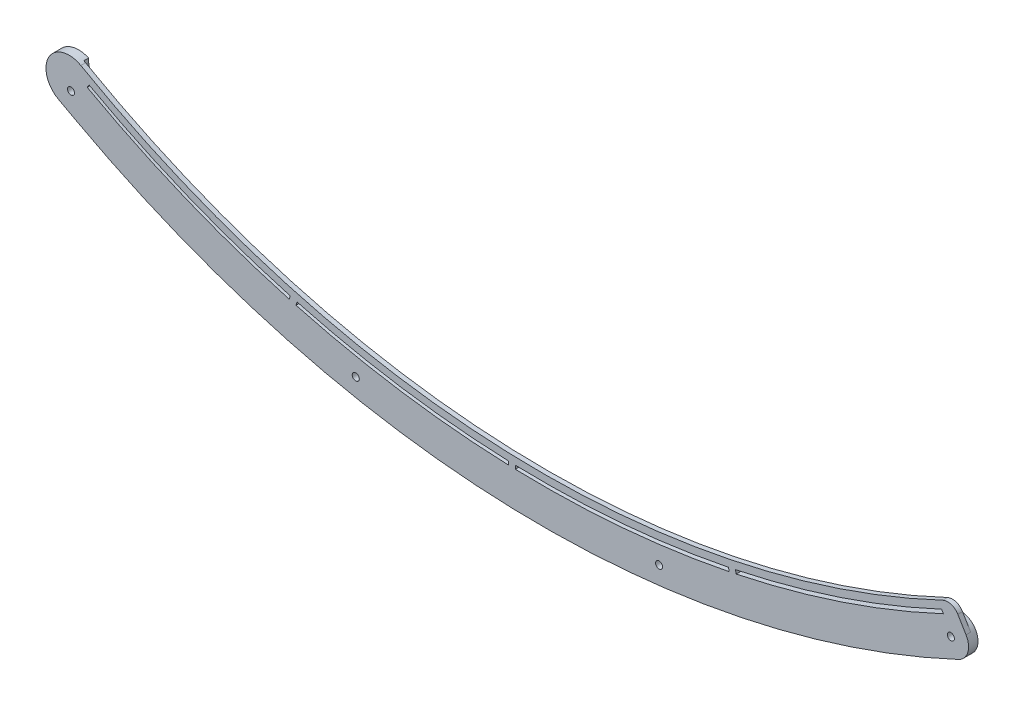
ISO-10303-21;
HEADER;
FILE_DESCRIPTION(('STEP AP214'),'2;1');
FILE_NAME('part.step','',(''),(''),'','','');
FILE_SCHEMA(('AUTOMOTIVE_DESIGN { 1 0 10303 214 1 1 1 1 }'));
ENDSEC;
DATA;
#1=APPLICATION_CONTEXT('core data for automotive mechanical design processes');
#2=APPLICATION_PROTOCOL_DEFINITION('international standard','automotive_design',2000,#1);
#3=PRODUCT_CONTEXT('',#1,'mechanical');
#4=PRODUCT('Part','Part','',(#3));
#5=PRODUCT_RELATED_PRODUCT_CATEGORY('part','',(#4));
#6=PRODUCT_DEFINITION_FORMATION('','',#4);
#7=PRODUCT_DEFINITION_CONTEXT('part definition',#1,'design');
#8=PRODUCT_DEFINITION('design','',#6,#7);
#9=PRODUCT_DEFINITION_SHAPE('','',#8);
#10=(LENGTH_UNIT() NAMED_UNIT(*) SI_UNIT(.MILLI.,.METRE.));
#11=(NAMED_UNIT(*) PLANE_ANGLE_UNIT() SI_UNIT($,.RADIAN.));
#12=(NAMED_UNIT(*) SI_UNIT($,.STERADIAN.) SOLID_ANGLE_UNIT());
#13=UNCERTAINTY_MEASURE_WITH_UNIT(LENGTH_MEASURE(1.E-05),#10,'distance_accuracy_value','');
#14=(GEOMETRIC_REPRESENTATION_CONTEXT(3) GLOBAL_UNCERTAINTY_ASSIGNED_CONTEXT((#13)) GLOBAL_UNIT_ASSIGNED_CONTEXT((#10,
#11,#12)) REPRESENTATION_CONTEXT('',''));
#15=CARTESIAN_POINT('',(0.,0.,0.));
#16=DIRECTION('',(0.,0.,1.));
#17=DIRECTION('',(1.,0.,0.));
#18=AXIS2_PLACEMENT_3D('',#15,#16,#17);
#19=CARTESIAN_POINT('',(0.,0.,2.));
#20=DIRECTION('',(0.,0.,1.));
#21=DIRECTION('',(1.,0.,0.));
#22=AXIS2_PLACEMENT_3D('',#19,#20,#21);
#23=CYLINDRICAL_SURFACE('',#22,398.5);
#24=DIRECTION('',(0.,0.,1.));
#25=VECTOR('',#24,1.);
#26=CARTESIAN_POINT('',(81.6819939898594,-390.038846601003,2.));
#27=LINE('',#26,#25);
#28=CARTESIAN_POINT('',(81.6819939898595,-390.038846601003,2.));
#29=VERTEX_POINT('',#28);
#30=CARTESIAN_POINT('',(81.6819939898595,-390.038846601003,4.));
#31=VERTEX_POINT('',#30);
#32=EDGE_CURVE('E236',#29,#31,#27,.T.);
#33=ORIENTED_EDGE('',*,*,#32,.F.);
#34=CARTESIAN_POINT('',(0.,0.,2.));
#35=DIRECTION('',(0.,0.,1.));
#36=DIRECTION('',(-1.,0.,0.));
#37=AXIS2_PLACEMENT_3D('',#34,#35,#36);
#38=CIRCLE('',#37,398.5);
#39=CARTESIAN_POINT('',(169.003770429104,-360.887760364281,2.));
#40=VERTEX_POINT('',#39);
#41=EDGE_CURVE('E336',#29,#40,#38,.T.);
#42=ORIENTED_EDGE('',*,*,#41,.T.);
#43=DIRECTION('',(0.,0.,1.));
#44=VECTOR('',#43,1.);
#45=CARTESIAN_POINT('',(169.003770429104,-360.887760364281,2.));
#46=LINE('',#45,#44);
#47=CARTESIAN_POINT('',(169.003770429104,-360.887760364281,4.));
#48=VERTEX_POINT('',#47);
#49=EDGE_CURVE('E324',#40,#48,#46,.T.);
#50=ORIENTED_EDGE('',*,*,#49,.T.);
#51=CARTESIAN_POINT('',(0.,0.,4.));
#52=DIRECTION('',(0.,0.,1.));
#53=DIRECTION('',(-1.,0.,0.));
#54=AXIS2_PLACEMENT_3D('',#51,#52,#53);
#55=CIRCLE('',#54,398.5);
#56=EDGE_CURVE('E71',#31,#48,#55,.T.);
#57=ORIENTED_EDGE('',*,*,#56,.F.);
#58=EDGE_LOOP('',(#33,#42,#50,#57));
#59=FACE_BOUND('',#58,.T.);
#60=ADVANCED_FACE('F48',(#59),#23,.T.);
#61=DIRECTION('',(0.,0.,1.));
#62=VECTOR('',#61,1.);
#63=CARTESIAN_POINT('',(78.7433976744266,-390.642710571549,2.));
#64=LINE('',#63,#62);
#65=CARTESIAN_POINT('',(78.7433976744266,-390.642710571549,4.));
#66=VERTEX_POINT('',#65);
#67=CARTESIAN_POINT('',(78.7433976744266,-390.642710571549,2.));
#68=VERTEX_POINT('',#67);
#69=EDGE_CURVE('E248',#66,#68,#64,.F.);
#70=ORIENTED_EDGE('',*,*,#69,.F.);
#71=CARTESIAN_POINT('',(-11.4984028552228,-398.334076789545,4.));
#72=VERTEX_POINT('',#71);
#73=EDGE_CURVE('E425',#72,#66,#55,.T.);
#74=ORIENTED_EDGE('',*,*,#73,.F.);
#75=DIRECTION('',(0.,0.,1.));
#76=VECTOR('',#75,1.);
#77=CARTESIAN_POINT('',(-11.4984028552228,-398.334076789545,2.));
#78=LINE('',#77,#76);
#79=CARTESIAN_POINT('',(-11.4984028552228,-398.334076789545,2.));
#80=VERTEX_POINT('',#79);
#81=EDGE_CURVE('E384',#80,#72,#78,.T.);
#82=ORIENTED_EDGE('',*,*,#81,.F.);
#83=EDGE_CURVE('E435',#80,#68,#38,.T.);
#84=ORIENTED_EDGE('',*,*,#83,.T.);
#85=EDGE_LOOP('',(#70,#74,#82,#84));
#86=FACE_BOUND('',#85,.T.);
#87=ADVANCED_FACE('F553',(#86),#23,.T.);
#88=DIRECTION('',(0.,0.,1.));
#89=VECTOR('',#88,1.);
#90=CARTESIAN_POINT('',(-14.4968066711785,-398.236227126989,2.));
#91=LINE('',#90,#89);
#92=CARTESIAN_POINT('',(-14.4968066711785,-398.236227126989,4.));
#93=VERTEX_POINT('',#92);
#94=CARTESIAN_POINT('',(-14.4968066711785,-398.236227126989,2.));
#95=VERTEX_POINT('',#94);
#96=EDGE_CURVE('E391',#93,#95,#91,.F.);
#97=ORIENTED_EDGE('',*,*,#96,.F.);
#98=CARTESIAN_POINT('',(-104.04513682366,-384.677604629313,4.));
#99=VERTEX_POINT('',#98);
#100=EDGE_CURVE('E346',#99,#93,#55,.T.);
#101=ORIENTED_EDGE('',*,*,#100,.F.);
#102=DIRECTION('',(0.,0.,1.));
#103=VECTOR('',#102,1.);
#104=CARTESIAN_POINT('',(-104.04513682366,-384.677604629313,2.));
#105=LINE('',#104,#103);
#106=CARTESIAN_POINT('',(-104.04513682366,-384.677604629313,2.));
#107=VERTEX_POINT('',#106);
#108=EDGE_CURVE('E12',#107,#99,#105,.T.);
#109=ORIENTED_EDGE('',*,*,#108,.F.);
#110=EDGE_CURVE('E358',#107,#95,#38,.T.);
#111=ORIENTED_EDGE('',*,*,#110,.T.);
#112=EDGE_LOOP('',(#97,#101,#109,#111));
#113=FACE_BOUND('',#112,.T.);
#114=ADVANCED_FACE('F558',(#113),#23,.T.);
#115=CARTESIAN_POINT('',(0.,0.,4.));
#116=DIRECTION('',(0.,0.,-1.));
#117=DIRECTION('',(-1.,0.,0.));
#118=AXIS2_PLACEMENT_3D('',#115,#116,#117);
#119=CYLINDRICAL_SURFACE('',#118,400.);
#120=CARTESIAN_POINT('',(0.,0.,2.));
#121=DIRECTION('',(0.,0.,-1.));
#122=DIRECTION('',(-1.,0.,0.));
#123=AXIS2_PLACEMENT_3D('',#120,#121,#122);
#124=CIRCLE('',#123,400.);
#125=CARTESIAN_POINT('',(79.0453317906727,-392.112019099265,2.));
#126=VERTEX_POINT('',#125);
#127=CARTESIAN_POINT('',(81.9839281061056,-391.508155128719,2.));
#128=VERTEX_POINT('',#127);
#129=EDGE_CURVE('E247',#126,#128,#124,.F.);
#130=ORIENTED_EDGE('',*,*,#129,.T.);
#131=DIRECTION('',(0.,0.,-1.));
#132=VECTOR('',#131,1.);
#133=CARTESIAN_POINT('',(81.9839281061056,-391.508155128719,4.));
#134=LINE('',#133,#132);
#135=CARTESIAN_POINT('',(81.9839281061056,-391.508155128719,4.));
#136=VERTEX_POINT('',#135);
#137=EDGE_CURVE('E234',#128,#136,#134,.F.);
#138=ORIENTED_EDGE('',*,*,#137,.T.);
#139=CARTESIAN_POINT('',(0.,0.,4.));
#140=DIRECTION('',(0.,0.,-1.));
#141=DIRECTION('',(-1.,0.,0.));
#142=AXIS2_PLACEMENT_3D('',#139,#140,#141);
#143=CIRCLE('',#142,400.);
#144=CARTESIAN_POINT('',(169.760416098082,-362.189730840351,4.));
#145=VERTEX_POINT('',#144);
#146=EDGE_CURVE('E244',#145,#136,#143,.T.);
#147=ORIENTED_EDGE('',*,*,#146,.F.);
#148=DIRECTION('',(0.,0.,1.));
#149=VECTOR('',#148,1.);
#150=CARTESIAN_POINT('',(169.760416098082,-362.189730840351,2.));
#151=LINE('',#150,#149);
#152=CARTESIAN_POINT('',(169.760416098082,-362.189730840351,2.));
#153=VERTEX_POINT('',#152);
#154=EDGE_CURVE('E326',#153,#145,#151,.T.);
#155=ORIENTED_EDGE('',*,*,#154,.F.);
#156=DIRECTION('',(0.,0.,1.));
#157=VECTOR('',#156,1.);
#158=CARTESIAN_POINT('',(169.760416098082,-362.189730840351,0.));
#159=LINE('',#158,#157);
#160=CARTESIAN_POINT('',(169.760416098082,-362.189730840351,0.));
#161=VERTEX_POINT('',#160);
#162=EDGE_CURVE('E286',#161,#153,#159,.T.);
#163=ORIENTED_EDGE('',*,*,#162,.F.);
#164=CARTESIAN_POINT('',(0.,0.,0.));
#165=DIRECTION('',(0.,0.,-1.));
#166=DIRECTION('',(-1.,0.,0.));
#167=AXIS2_PLACEMENT_3D('',#164,#165,#166);
#168=CIRCLE('',#167,400.);
#169=CARTESIAN_POINT('',(-192.90268679393,-350.411976718381,0.));
#170=VERTEX_POINT('',#169);
#171=EDGE_CURVE('E275',#161,#170,#168,.T.);
#172=ORIENTED_EDGE('',*,*,#171,.T.);
#173=DIRECTION('',(0.,0.,-1.));
#174=VECTOR('',#173,1.);
#175=CARTESIAN_POINT('',(-192.90268679393,-350.411976718381,4.));
#176=LINE('',#175,#174);
#177=CARTESIAN_POINT('',(-192.90268679393,-350.411976718381,2.));
#178=VERTEX_POINT('',#177);
#179=EDGE_CURVE('E259',#170,#178,#176,.F.);
#180=ORIENTED_EDGE('',*,*,#179,.T.);
#181=CARTESIAN_POINT('',(0.,0.,2.));
#182=DIRECTION('',(0.,0.,-1.));
#183=DIRECTION('',(-1.,0.,0.));
#184=AXIS2_PLACEMENT_3D('',#181,#182,#183);
#185=CIRCLE('',#184,400.);
#186=CARTESIAN_POINT('',(-192.896852500104,-350.415188448722,2.));
#187=VERTEX_POINT('',#186);
#188=EDGE_CURVE('E318',#178,#187,#185,.F.);
#189=ORIENTED_EDGE('',*,*,#188,.T.);
#190=DIRECTION('',(0.,0.,-1.));
#191=VECTOR('',#190,1.);
#192=CARTESIAN_POINT('',(-192.896852500104,-350.415188448722,4.));
#193=LINE('',#192,#191);
#194=CARTESIAN_POINT('',(-192.896852500104,-350.415188448722,4.));
#195=VERTEX_POINT('',#194);
#196=EDGE_CURVE('E311',#187,#195,#193,.F.);
#197=ORIENTED_EDGE('',*,*,#196,.T.);
#198=CARTESIAN_POINT('',(-107.335198046821,-385.329930397639,4.));
#199=VERTEX_POINT('',#198);
#200=EDGE_CURVE('E258',#199,#195,#143,.T.);
#201=ORIENTED_EDGE('',*,*,#200,.F.);
#202=DIRECTION('',(0.,0.,-1.));
#203=VECTOR('',#202,1.);
#204=CARTESIAN_POINT('',(-107.335198046821,-385.329930397639,4.));
#205=LINE('',#204,#203);
#206=CARTESIAN_POINT('',(-107.335198046821,-385.329930397639,2.));
#207=VERTEX_POINT('',#206);
#208=EDGE_CURVE('E369',#199,#207,#205,.T.);
#209=ORIENTED_EDGE('',*,*,#208,.T.);
#210=CARTESIAN_POINT('',(0.,0.,2.));
#211=DIRECTION('',(0.,0.,-1.));
#212=DIRECTION('',(-1.,0.,0.));
#213=AXIS2_PLACEMENT_3D('',#210,#211,#212);
#214=CIRCLE('',#213,400.);
#215=CARTESIAN_POINT('',(-104.442225086599,-386.124101318424,2.));
#216=VERTEX_POINT('',#215);
#217=EDGE_CURVE('E372',#207,#216,#214,.F.);
#218=ORIENTED_EDGE('',*,*,#217,.T.);
#219=DIRECTION('',(0.,0.,-1.));
#220=VECTOR('',#219,1.);
#221=CARTESIAN_POINT('',(-104.442225086599,-386.124101318424,4.));
#222=LINE('',#221,#220);
#223=CARTESIAN_POINT('',(-104.442225086599,-386.124101318424,4.));
#224=VERTEX_POINT('',#223);
#225=EDGE_CURVE('E366',#216,#224,#222,.F.);
#226=ORIENTED_EDGE('',*,*,#225,.T.);
#227=CARTESIAN_POINT('',(-14.5457318477578,-399.73543961602,4.));
#228=VERTEX_POINT('',#227);
#229=EDGE_CURVE('E261',#228,#224,#143,.T.);
#230=ORIENTED_EDGE('',*,*,#229,.F.);
#231=DIRECTION('',(0.,0.,-1.));
#232=VECTOR('',#231,1.);
#233=CARTESIAN_POINT('',(-14.5457318477578,-399.73543961602,4.));
#234=LINE('',#233,#232);
#235=CARTESIAN_POINT('',(-14.5457318477578,-399.73543961602,2.));
#236=VERTEX_POINT('',#235);
#237=EDGE_CURVE('E394',#228,#236,#234,.T.);
#238=ORIENTED_EDGE('',*,*,#237,.T.);
#239=CARTESIAN_POINT('',(0.,0.,2.));
#240=DIRECTION('',(0.,0.,-1.));
#241=DIRECTION('',(-1.,0.,0.));
#242=AXIS2_PLACEMENT_3D('',#239,#240,#241);
#243=CIRCLE('',#242,400.);
#244=CARTESIAN_POINT('',(-11.5473280318021,-399.833289278577,2.));
#245=VERTEX_POINT('',#244);
#246=EDGE_CURVE('E397',#236,#245,#243,.F.);
#247=ORIENTED_EDGE('',*,*,#246,.T.);
#248=DIRECTION('',(0.,0.,-1.));
#249=VECTOR('',#248,1.);
#250=CARTESIAN_POINT('',(-11.5473280318021,-399.833289278577,4.));
#251=LINE('',#250,#249);
#252=CARTESIAN_POINT('',(-11.5473280318021,-399.833289278577,4.));
#253=VERTEX_POINT('',#252);
#254=EDGE_CURVE('E388',#245,#253,#251,.F.);
#255=ORIENTED_EDGE('',*,*,#254,.T.);
#256=CARTESIAN_POINT('',(79.0453317906727,-392.112019099265,4.));
#257=VERTEX_POINT('',#256);
#258=EDGE_CURVE('E256',#257,#253,#143,.T.);
#259=ORIENTED_EDGE('',*,*,#258,.F.);
#260=DIRECTION('',(0.,0.,-1.));
#261=VECTOR('',#260,1.);
#262=CARTESIAN_POINT('',(79.0453317906727,-392.112019099265,4.));
#263=LINE('',#262,#261);
#264=EDGE_CURVE('E413',#257,#126,#263,.T.);
#265=ORIENTED_EDGE('',*,*,#264,.T.);
#266=EDGE_LOOP('',(#130,#138,#147,#155,#163,#172,#180,#189,#197,#201,#209,#218,#226,#230,#238,
#247,#255,#259,#265));
#267=FACE_BOUND('',#266,.T.);
#268=ADVANCED_FACE('F243',(#267),#119,.F.);
#269=CARTESIAN_POINT('',(0.,0.,4.));
#270=DIRECTION('',(0.,0.,1.));
#271=DIRECTION('',(1.,0.,0.));
#272=AXIS2_PLACEMENT_3D('',#269,#270,#271);
#273=PLANE('',#272);
#274=ORIENTED_EDGE('',*,*,#73,.T.);
#275=DIRECTION('',(0.201287990182129,-0.979532105144308,0.));
#276=VECTOR('',#275,1.);
#277=CARTESIAN_POINT('',(80.152981861137,-397.50220062129,4.));
#278=LINE('',#277,#276);
#279=EDGE_CURVE('E239',#66,#257,#278,.T.);
#280=ORIENTED_EDGE('',*,*,#279,.T.);
#281=ORIENTED_EDGE('',*,*,#258,.T.);
#282=DIRECTION('',(0.0326165541854028,0.999467938651896,0.));
#283=VECTOR('',#282,1.);
#284=CARTESIAN_POINT('',(-11.726810814203,-405.333173954622,4.));
#285=LINE('',#284,#283);
#286=EDGE_CURVE('E406',#253,#72,#285,.T.);
#287=ORIENTED_EDGE('',*,*,#286,.T.);
#288=EDGE_LOOP('',(#274,#280,#281,#287));
#289=FACE_BOUND('',#288,.T.);
#290=ORIENTED_EDGE('',*,*,#146,.T.);
#291=DIRECTION('',(-0.20128799018213,0.979532105144308,0.));
#292=VECTOR('',#291,1.);
#293=CARTESIAN_POINT('',(83.09157817657,-396.898336650744,4.));
#294=LINE('',#293,#292);
#295=EDGE_CURVE('E230',#136,#31,#294,.T.);
#296=ORIENTED_EDGE('',*,*,#295,.T.);
#297=ORIENTED_EDGE('',*,*,#56,.T.);
#298=DIRECTION('',(0.502464653495258,-0.864597751551489,0.));
#299=VECTOR('',#298,1.);
#300=CARTESIAN_POINT('',(169.003770429104,-360.887760364281,4.));
#301=LINE('',#300,#299);
#302=EDGE_CURVE('E254',#48,#145,#301,.T.);
#303=ORIENTED_EDGE('',*,*,#302,.T.);
#304=EDGE_LOOP('',(#290,#296,#297,#303));
#305=FACE_BOUND('',#304,.T.);
#306=CARTESIAN_POINT('',(0.,0.,4.));
#307=DIRECTION('',(0.,0.,-1.));
#308=DIRECTION('',(1.,0.,0.));
#309=AXIS2_PLACEMENT_3D('',#306,#307,#308);
#310=CIRCLE('',#309,395.5);
#311=CARTESIAN_POINT('',(169.454723344945,-357.358848688665,4.));
#312=VERTEX_POINT('',#311);
#313=CARTESIAN_POINT('',(-195.616677725344,-343.735894831627,4.));
#314=VERTEX_POINT('',#313);
#315=EDGE_CURVE('E337',#312,#314,#310,.T.);
#316=ORIENTED_EDGE('',*,*,#315,.T.);
#317=CARTESIAN_POINT('',(-200.562737844821,-352.42706789943,4.));
#318=DIRECTION('',(0.,0.,1.));
#319=DIRECTION('',(1.,0.,0.));
#320=AXIS2_PLACEMENT_3D('',#317,#318,#319);
#321=CIRCLE('',#320,10.);
#322=CARTESIAN_POINT('',(-209.252232214568,-347.478059150383,4.));
#323=VERTEX_POINT('',#322);
#324=EDGE_CURVE('E490',#314,#323,#321,.T.);
#325=ORIENTED_EDGE('',*,*,#324,.T.);
#326=CARTESIAN_POINT('',(-200.364710514774,-352.061939388313,4.));
#327=DIRECTION('',(0.,0.,1.));
#328=DIRECTION('',(1.,0.,0.));
#329=AXIS2_PLACEMENT_3D('',#326,#327,#328);
#330=CIRCLE('',#329,10.);
#331=CARTESIAN_POINT('',(-205.13218330603,-360.85234342821,4.));
#332=VERTEX_POINT('',#331);
#333=EDGE_CURVE('E488',#323,#332,#330,.T.);
#334=ORIENTED_EDGE('',*,*,#333,.T.);
#335=DIRECTION('',(-0.879040403989637,0.476747279125677,0.));
#336=VECTOR('',#335,1.);
#337=CARTESIAN_POINT('',(-213.922587345927,-356.084870636953,4.));
#338=LINE('',#337,#336);
#339=CARTESIAN_POINT('',(-197.850120837155,-364.8017676557,4.));
#340=VERTEX_POINT('',#339);
#341=EDGE_CURVE('E359',#340,#332,#338,.T.);
#342=ORIENTED_EDGE('',*,*,#341,.F.);
#343=CARTESIAN_POINT('',(0.,0.,4.));
#344=DIRECTION('',(0.,0.,1.));
#345=DIRECTION('',(1.,0.,0.));
#346=AXIS2_PLACEMENT_3D('',#343,#344,#345);
#347=CIRCLE('',#346,415.);
#348=CARTESIAN_POINT('',(176.12643170176,-375.771845746865,4.));
#349=VERTEX_POINT('',#348);
#350=EDGE_CURVE('E264',#340,#349,#347,.T.);
#351=ORIENTED_EDGE('',*,*,#350,.T.);
#352=CARTESIAN_POINT('',(172.943423899921,-368.980788293608,4.));
#353=DIRECTION('',(0.,0.,1.));
#354=DIRECTION('',(1.,0.,0.));
#355=AXIS2_PLACEMENT_3D('',#352,#353,#354);
#356=CIRCLE('',#355,7.50000000000006);
#357=CARTESIAN_POINT('',(179.374906332316,-365.122545983722,4.));
#358=VERTEX_POINT('',#357);
#359=EDGE_CURVE('E291',#358,#349,#356,.F.);
#360=ORIENTED_EDGE('',*,*,#359,.F.);
#361=DIRECTION('',(-0.514432307984768,0.85753099098602,0.));
#362=VECTOR('',#361,1.);
#363=CARTESIAN_POINT('',(179.374906332316,-365.122545983722,4.));
#364=LINE('',#363,#362);
#365=CARTESIAN_POINT('',(175.884663045071,-359.304498130899,4.));
#366=VERTEX_POINT('',#365);
#367=EDGE_CURVE('E339',#358,#366,#364,.T.);
#368=ORIENTED_EDGE('',*,*,#367,.T.);
#369=CARTESIAN_POINT('',(171.59700809014,-361.876659670822,4.));
#370=DIRECTION('',(0.,0.,1.));
#371=DIRECTION('',(1.,0.,0.));
#372=AXIS2_PLACEMENT_3D('',#369,#370,#371);
#373=CIRCLE('',#372,5.);
#374=EDGE_CURVE('E454',#366,#312,#373,.T.);
#375=ORIENTED_EDGE('',*,*,#374,.T.);
#376=EDGE_LOOP('',(#316,#325,#334,#342,#351,#360,#368,#375));
#377=FACE_BOUND('',#376,.T.);
#378=ORIENTED_EDGE('',*,*,#100,.T.);
#379=DIRECTION('',(-0.0326165541854028,-0.999467938651896,0.));
#380=VECTOR('',#379,1.);
#381=CARTESIAN_POINT('',(-14.7252146301587,-405.235324292066,4.));
#382=LINE('',#381,#380);
#383=EDGE_CURVE('E405',#93,#228,#382,.T.);
#384=ORIENTED_EDGE('',*,*,#383,.T.);
#385=ORIENTED_EDGE('',*,*,#229,.T.);
#386=DIRECTION('',(0.264723640261418,0.964324320074291,0.));
#387=VECTOR('',#386,1.);
#388=CARTESIAN_POINT('',(-105.898949645892,-391.430597250518,4.));
#389=LINE('',#388,#387);
#390=EDGE_CURVE('E381',#224,#99,#389,.T.);
#391=ORIENTED_EDGE('',*,*,#390,.T.);
#392=EDGE_LOOP('',(#378,#384,#385,#391));
#393=FACE_BOUND('',#392,.T.);
#394=DIRECTION('',(-0.264723640261414,-0.964324320074292,0.));
#395=VECTOR('',#394,1.);
#396=CARTESIAN_POINT('',(-108.791922606115,-390.636426329733,4.));
#397=LINE('',#396,#395);
#398=CARTESIAN_POINT('',(-106.938109783883,-383.883433708528,4.));
#399=VERTEX_POINT('',#398);
#400=EDGE_CURVE('E380',#399,#199,#397,.T.);
#401=ORIENTED_EDGE('',*,*,#400,.T.);
#402=ORIENTED_EDGE('',*,*,#200,.T.);
#403=DIRECTION('',(0.50570947221603,0.862703848206894,0.));
#404=VECTOR('',#403,1.);
#405=CARTESIAN_POINT('',(-194.594747808509,-353.311675259606,4.));
#406=LINE('',#405,#404);
#407=CARTESIAN_POINT('',(-192.138010837397,-349.120659359265,4.));
#408=VERTEX_POINT('',#407);
#409=EDGE_CURVE('E334',#195,#408,#406,.T.);
#410=ORIENTED_EDGE('',*,*,#409,.T.);
#411=EDGE_CURVE('E343',#408,#399,#55,.T.);
#412=ORIENTED_EDGE('',*,*,#411,.T.);
#413=EDGE_LOOP('',(#401,#402,#410,#412));
#414=FACE_BOUND('',#413,.T.);
#415=CARTESIAN_POINT('',(172.943423899921,-368.980788293608,4.));
#416=DIRECTION('',(0.,0.,1.));
#417=DIRECTION('',(1.,0.,0.));
#418=AXIS2_PLACEMENT_3D('',#415,#416,#417);
#419=CIRCLE('',#418,1.5);
#420=CARTESIAN_POINT('',(174.443423899921,-368.980788293608,4.));
#421=VERTEX_POINT('',#420);
#422=EDGE_CURVE('E278',#421,#421,#419,.T.);
#423=ORIENTED_EDGE('',*,*,#422,.F.);
#424=EDGE_LOOP('',(#423));
#425=FACE_BOUND('',#424,.T.);
#426=CARTESIAN_POINT('',(49.35287480585,-404.500363100453,4.));
#427=DIRECTION('',(0.,0.,1.));
#428=DIRECTION('',(1.,0.,0.));
#429=AXIS2_PLACEMENT_3D('',#426,#427,#428);
#430=CIRCLE('',#429,1.5);
#431=CARTESIAN_POINT('',(50.85287480585,-404.500363100453,4.));
#432=VERTEX_POINT('',#431);
#433=EDGE_CURVE('E296',#432,#432,#430,.T.);
#434=ORIENTED_EDGE('',*,*,#433,.F.);
#435=EDGE_LOOP('',(#434));
#436=FACE_BOUND('',#435,.T.);
#437=CARTESIAN_POINT('',(-79.1523472856375,-399.738859656118,4.));
#438=DIRECTION('',(0.,0.,1.));
#439=DIRECTION('',(1.,0.,0.));
#440=AXIS2_PLACEMENT_3D('',#437,#438,#439);
#441=CIRCLE('',#440,1.5);
#442=CARTESIAN_POINT('',(-77.6523472856375,-399.738859656118,4.));
#443=VERTEX_POINT('',#442);
#444=EDGE_CURVE('E302',#443,#443,#441,.T.);
#445=ORIENTED_EDGE('',*,*,#444,.F.);
#446=EDGE_LOOP('',(#445));
#447=FACE_BOUND('',#446,.T.);
#448=CARTESIAN_POINT('',(-199.775396242992,-355.170439445564,4.));
#449=DIRECTION('',(0.,0.,1.));
#450=DIRECTION('',(1.,0.,0.));
#451=AXIS2_PLACEMENT_3D('',#448,#449,#450);
#452=CIRCLE('',#451,1.5);
#453=CARTESIAN_POINT('',(-198.275396242992,-355.170439445564,4.));
#454=VERTEX_POINT('',#453);
#455=EDGE_CURVE('E308',#454,#454,#452,.T.);
#456=ORIENTED_EDGE('',*,*,#455,.F.);
#457=EDGE_LOOP('',(#456));
#458=FACE_BOUND('',#457,.T.);
#459=ADVANCED_FACE('F251',(#289,#305,#377,#393,#414,#425,#436,#447,#458),#273,.T.);
#460=CARTESIAN_POINT('',(0.,0.,0.));
#461=DIRECTION('',(0.,0.,1.));
#462=DIRECTION('',(1.,0.,0.));
#463=AXIS2_PLACEMENT_3D('',#460,#461,#462);
#464=PLANE('',#463);
#465=CARTESIAN_POINT('',(-200.364710514774,-352.061939388313,0.));
#466=DIRECTION('',(0.,0.,1.));
#467=DIRECTION('',(1.,0.,0.));
#468=AXIS2_PLACEMENT_3D('',#465,#466,#467);
#469=CIRCLE('',#468,10.);
#470=CARTESIAN_POINT('',(-205.13218330603,-360.85234342821,0.));
#471=VERTEX_POINT('',#470);
#472=CARTESIAN_POINT('',(-209.252232214568,-347.478059150383,0.));
#473=VERTEX_POINT('',#472);
#474=EDGE_CURVE('E492',#471,#473,#469,.F.);
#475=ORIENTED_EDGE('',*,*,#474,.T.);
#476=CARTESIAN_POINT('',(-200.562737844821,-352.42706789943,0.));
#477=DIRECTION('',(0.,0.,1.));
#478=DIRECTION('',(1.,0.,0.));
#479=AXIS2_PLACEMENT_3D('',#476,#477,#478);
#480=CIRCLE('',#479,10.);
#481=CARTESIAN_POINT('',(-196.335419109296,-343.364519896342,0.));
#482=VERTEX_POINT('',#481);
#483=EDGE_CURVE('E494',#473,#482,#480,.F.);
#484=ORIENTED_EDGE('',*,*,#483,.T.);
#485=DIRECTION('',(-0.0449098212974589,0.998991044980399,0.));
#486=VECTOR('',#485,1.);
#487=CARTESIAN_POINT('',(-199.971644797477,-262.478940860964,0.));
#488=LINE('',#487,#486);
#489=CARTESIAN_POINT('',(-196.261459925901,-345.00969593514,0.));
#490=VERTEX_POINT('',#489);
#491=EDGE_CURVE('E270',#490,#482,#488,.T.);
#492=ORIENTED_EDGE('',*,*,#491,.F.);
#493=CARTESIAN_POINT('',(-189.768018133529,-344.717782096707,0.));
#494=DIRECTION('',(0.,0.,1.));
#495=DIRECTION('',(1.,0.,0.));
#496=AXIS2_PLACEMENT_3D('',#493,#494,#495);
#497=CIRCLE('',#496,6.5);
#498=EDGE_CURVE('E466',#490,#170,#497,.T.);
#499=ORIENTED_EDGE('',*,*,#498,.T.);
#500=ORIENTED_EDGE('',*,*,#171,.F.);
#501=CARTESIAN_POINT('',(172.943423899921,-368.980788293608,0.));
#502=DIRECTION('',(0.,0.,1.));
#503=DIRECTION('',(1.,0.,0.));
#504=AXIS2_PLACEMENT_3D('',#501,#502,#503);
#505=CIRCLE('',#504,7.50000000000006);
#506=CARTESIAN_POINT('',(176.12643170176,-375.771845746865,0.));
#507=VERTEX_POINT('',#506);
#508=EDGE_CURVE('E289',#161,#507,#505,.F.);
#509=ORIENTED_EDGE('',*,*,#508,.T.);
#510=CARTESIAN_POINT('',(0.,0.,0.));
#511=DIRECTION('',(0.,0.,1.));
#512=DIRECTION('',(1.,0.,0.));
#513=AXIS2_PLACEMENT_3D('',#510,#511,#512);
#514=CIRCLE('',#513,415.);
#515=CARTESIAN_POINT('',(-197.850120837155,-364.8017676557,0.));
#516=VERTEX_POINT('',#515);
#517=EDGE_CURVE('E285',#516,#507,#514,.T.);
#518=ORIENTED_EDGE('',*,*,#517,.F.);
#519=DIRECTION('',(-0.879040403989637,0.476747279125677,0.));
#520=VECTOR('',#519,1.);
#521=CARTESIAN_POINT('',(-213.922587345927,-356.084870636953,0.));
#522=LINE('',#521,#520);
#523=EDGE_CURVE('E362',#516,#471,#522,.T.);
#524=ORIENTED_EDGE('',*,*,#523,.T.);
#525=EDGE_LOOP('',(#475,#484,#492,#499,#500,#509,#518,#524));
#526=FACE_BOUND('',#525,.T.);
#527=CARTESIAN_POINT('',(172.943423899921,-368.980788293608,0.));
#528=DIRECTION('',(0.,0.,1.));
#529=DIRECTION('',(1.,0.,0.));
#530=AXIS2_PLACEMENT_3D('',#527,#528,#529);
#531=CIRCLE('',#530,1.5);
#532=CARTESIAN_POINT('',(174.443423899921,-368.980788293608,0.));
#533=VERTEX_POINT('',#532);
#534=EDGE_CURVE('E281',#533,#533,#531,.T.);
#535=ORIENTED_EDGE('',*,*,#534,.T.);
#536=EDGE_LOOP('',(#535));
#537=FACE_BOUND('',#536,.T.);
#538=CARTESIAN_POINT('',(49.35287480585,-404.500363100453,0.));
#539=DIRECTION('',(0.,0.,1.));
#540=DIRECTION('',(1.,0.,0.));
#541=AXIS2_PLACEMENT_3D('',#538,#539,#540);
#542=CIRCLE('',#541,1.5);
#543=CARTESIAN_POINT('',(50.85287480585,-404.500363100453,0.));
#544=VERTEX_POINT('',#543);
#545=EDGE_CURVE('E293',#544,#544,#542,.T.);
#546=ORIENTED_EDGE('',*,*,#545,.T.);
#547=EDGE_LOOP('',(#546));
#548=FACE_BOUND('',#547,.T.);
#549=CARTESIAN_POINT('',(-79.1523472856375,-399.738859656118,0.));
#550=DIRECTION('',(0.,0.,1.));
#551=DIRECTION('',(1.,0.,0.));
#552=AXIS2_PLACEMENT_3D('',#549,#550,#551);
#553=CIRCLE('',#552,1.5);
#554=CARTESIAN_POINT('',(-77.6523472856375,-399.738859656118,0.));
#555=VERTEX_POINT('',#554);
#556=EDGE_CURVE('E299',#555,#555,#553,.T.);
#557=ORIENTED_EDGE('',*,*,#556,.T.);
#558=EDGE_LOOP('',(#557));
#559=FACE_BOUND('',#558,.T.);
#560=CARTESIAN_POINT('',(-199.775396242992,-355.170439445564,0.));
#561=DIRECTION('',(0.,0.,1.));
#562=DIRECTION('',(1.,0.,0.));
#563=AXIS2_PLACEMENT_3D('',#560,#561,#562);
#564=CIRCLE('',#563,1.5);
#565=CARTESIAN_POINT('',(-198.275396242992,-355.170439445564,0.));
#566=VERTEX_POINT('',#565);
#567=EDGE_CURVE('E305',#566,#566,#564,.T.);
#568=ORIENTED_EDGE('',*,*,#567,.T.);
#569=EDGE_LOOP('',(#568));
#570=FACE_BOUND('',#569,.T.);
#571=ADVANCED_FACE('F461',(#526,#537,#548,#559,#570),#464,.F.);
#572=CARTESIAN_POINT('',(0.,0.,4.));
#573=DIRECTION('',(0.,0.,-1.));
#574=DIRECTION('',(-1.,0.,0.));
#575=AXIS2_PLACEMENT_3D('',#572,#573,#574);
#576=CYLINDRICAL_SURFACE('',#575,415.);
#577=ORIENTED_EDGE('',*,*,#350,.F.);
#578=DIRECTION('',(0.,0.,-1.));
#579=VECTOR('',#578,1.);
#580=CARTESIAN_POINT('',(-197.850120837155,-364.8017676557,4.));
#581=LINE('',#580,#579);
#582=EDGE_CURVE('E472',#340,#516,#581,.T.);
#583=ORIENTED_EDGE('',*,*,#582,.T.);
#584=ORIENTED_EDGE('',*,*,#517,.T.);
#585=DIRECTION('',(0.,0.,1.));
#586=VECTOR('',#585,1.);
#587=CARTESIAN_POINT('',(176.12643170176,-375.771845746865,0.));
#588=LINE('',#587,#586);
#589=EDGE_CURVE('E282',#507,#349,#588,.T.);
#590=ORIENTED_EDGE('',*,*,#589,.T.);
#591=EDGE_LOOP('',(#577,#583,#584,#590));
#592=FACE_BOUND('',#591,.T.);
#593=ADVANCED_FACE('F675',(#592),#576,.T.);
#594=CARTESIAN_POINT('',(-199.971644797477,-262.478940860964,4.));
#595=DIRECTION('',(-0.998991044980399,-0.044909821297459,0.));
#596=DIRECTION('',(0.044909821297459,-0.998991044980399,0.));
#597=AXIS2_PLACEMENT_3D('',#594,#595,#596);
#598=PLANE('',#597);
#599=ORIENTED_EDGE('',*,*,#491,.T.);
#600=DIRECTION('',(0.,0.,1.));
#601=VECTOR('',#600,1.);
#602=CARTESIAN_POINT('',(-196.335419109296,-343.364519896342,0.));
#603=LINE('',#602,#601);
#604=CARTESIAN_POINT('',(-196.335419109296,-343.364519896342,2.));
#605=VERTEX_POINT('',#604);
#606=EDGE_CURVE('E496',#482,#605,#603,.T.);
#607=ORIENTED_EDGE('',*,*,#606,.T.);
#608=DIRECTION('',(0.044909821297459,-0.998991044980399,0.));
#609=VECTOR('',#608,1.);
#610=CARTESIAN_POINT('',(-199.971644797477,-262.478940860964,2.));
#611=LINE('',#610,#609);
#612=CARTESIAN_POINT('',(-196.261459925901,-345.00969593514,2.));
#613=VERTEX_POINT('',#612);
#614=EDGE_CURVE('E321',#605,#613,#611,.T.);
#615=ORIENTED_EDGE('',*,*,#614,.T.);
#616=DIRECTION('',(0.,0.,1.));
#617=VECTOR('',#616,1.);
#618=CARTESIAN_POINT('',(-196.261459925901,-345.00969593514,0.));
#619=LINE('',#618,#617);
#620=EDGE_CURVE('E255',#613,#490,#619,.F.);
#621=ORIENTED_EDGE('',*,*,#620,.T.);
#622=EDGE_LOOP('',(#599,#607,#615,#621));
#623=FACE_BOUND('',#622,.T.);
#624=ADVANCED_FACE('F664',(#623),#598,.F.);
#625=CARTESIAN_POINT('',(172.943423899921,-368.980788293608,0.));
#626=DIRECTION('',(0.,0.,1.));
#627=DIRECTION('',(1.,0.,0.));
#628=AXIS2_PLACEMENT_3D('',#625,#626,#627);
#629=CYLINDRICAL_SURFACE('',#628,1.5);
#630=ORIENTED_EDGE('',*,*,#534,.F.);
#631=EDGE_LOOP('',(#630));
#632=FACE_BOUND('',#631,.T.);
#633=ORIENTED_EDGE('',*,*,#422,.T.);
#634=EDGE_LOOP('',(#633));
#635=FACE_BOUND('',#634,.T.);
#636=ADVANCED_FACE('F631',(#632,#635),#629,.F.);
#637=CARTESIAN_POINT('',(172.943423899921,-368.980788293608,0.));
#638=DIRECTION('',(0.,0.,1.));
#639=DIRECTION('',(1.,0.,0.));
#640=AXIS2_PLACEMENT_3D('',#637,#638,#639);
#641=CYLINDRICAL_SURFACE('',#640,7.50000000000006);
#642=CARTESIAN_POINT('',(172.943423899921,-368.980788293608,2.));
#643=DIRECTION('',(0.,0.,-1.));
#644=DIRECTION('',(-1.,0.,0.));
#645=AXIS2_PLACEMENT_3D('',#642,#643,#644);
#646=CIRCLE('',#645,7.50000000000006);
#647=CARTESIAN_POINT('',(179.374906332316,-365.122545983722,2.));
#648=VERTEX_POINT('',#647);
#649=EDGE_CURVE('E316',#153,#648,#646,.T.);
#650=ORIENTED_EDGE('',*,*,#649,.T.);
#651=DIRECTION('',(0.,0.,1.));
#652=VECTOR('',#651,1.);
#653=CARTESIAN_POINT('',(179.374906332316,-365.122545983722,2.));
#654=LINE('',#653,#652);
#655=EDGE_CURVE('E329',#648,#358,#654,.T.);
#656=ORIENTED_EDGE('',*,*,#655,.T.);
#657=ORIENTED_EDGE('',*,*,#359,.T.);
#658=ORIENTED_EDGE('',*,*,#589,.F.);
#659=ORIENTED_EDGE('',*,*,#508,.F.);
#660=ORIENTED_EDGE('',*,*,#162,.T.);
#661=EDGE_LOOP('',(#650,#656,#657,#658,#659,#660));
#662=FACE_BOUND('',#661,.T.);
#663=ADVANCED_FACE('F445',(#662),#641,.T.);
#664=CARTESIAN_POINT('',(49.35287480585,-404.500363100453,0.));
#665=DIRECTION('',(0.,0.,1.));
#666=DIRECTION('',(1.,0.,0.));
#667=AXIS2_PLACEMENT_3D('',#664,#665,#666);
#668=CYLINDRICAL_SURFACE('',#667,1.5);
#669=ORIENTED_EDGE('',*,*,#545,.F.);
#670=EDGE_LOOP('',(#669));
#671=FACE_BOUND('',#670,.T.);
#672=ORIENTED_EDGE('',*,*,#433,.T.);
#673=EDGE_LOOP('',(#672));
#674=FACE_BOUND('',#673,.T.);
#675=ADVANCED_FACE('F630',(#671,#674),#668,.F.);
#676=CARTESIAN_POINT('',(-79.1523472856375,-399.738859656118,0.));
#677=DIRECTION('',(0.,0.,1.));
#678=DIRECTION('',(1.,0.,0.));
#679=AXIS2_PLACEMENT_3D('',#676,#677,#678);
#680=CYLINDRICAL_SURFACE('',#679,1.5);
#681=ORIENTED_EDGE('',*,*,#556,.F.);
#682=EDGE_LOOP('',(#681));
#683=FACE_BOUND('',#682,.T.);
#684=ORIENTED_EDGE('',*,*,#444,.T.);
#685=EDGE_LOOP('',(#684));
#686=FACE_BOUND('',#685,.T.);
#687=ADVANCED_FACE('F642',(#683,#686),#680,.F.);
#688=CARTESIAN_POINT('',(-199.775396242992,-355.170439445564,0.));
#689=DIRECTION('',(0.,0.,1.));
#690=DIRECTION('',(1.,0.,0.));
#691=AXIS2_PLACEMENT_3D('',#688,#689,#690);
#692=CYLINDRICAL_SURFACE('',#691,1.5);
#693=ORIENTED_EDGE('',*,*,#567,.F.);
#694=EDGE_LOOP('',(#693));
#695=FACE_BOUND('',#694,.T.);
#696=ORIENTED_EDGE('',*,*,#455,.T.);
#697=EDGE_LOOP('',(#696));
#698=FACE_BOUND('',#697,.T.);
#699=ADVANCED_FACE('F619',(#695,#698),#692,.F.);
#700=CARTESIAN_POINT('',(-189.768018133529,-344.717782096707,4.));
#701=DIRECTION('',(0.,0.,-1.));
#702=DIRECTION('',(-1.,0.,0.));
#703=AXIS2_PLACEMENT_3D('',#700,#701,#702);
#704=CYLINDRICAL_SURFACE('',#703,6.5);
#705=ORIENTED_EDGE('',*,*,#620,.F.);
#706=CARTESIAN_POINT('',(-189.768018133529,-344.717782096707,2.));
#707=DIRECTION('',(0.,0.,-1.));
#708=DIRECTION('',(-1.,0.,0.));
#709=AXIS2_PLACEMENT_3D('',#706,#707,#708);
#710=CIRCLE('',#709,6.5);
#711=EDGE_CURVE('E476',#613,#178,#710,.F.);
#712=ORIENTED_EDGE('',*,*,#711,.T.);
#713=ORIENTED_EDGE('',*,*,#179,.F.);
#714=ORIENTED_EDGE('',*,*,#498,.F.);
#715=EDGE_LOOP('',(#705,#712,#713,#714));
#716=FACE_BOUND('',#715,.T.);
#717=ADVANCED_FACE('F524',(#716),#704,.F.);
#718=CARTESIAN_POINT('',(-194.594747808509,-353.311675259606,2.));
#719=DIRECTION('',(0.862703848206894,-0.50570947221603,0.));
#720=DIRECTION('',(0.50570947221603,0.862703848206894,0.));
#721=AXIS2_PLACEMENT_3D('',#718,#719,#720);
#722=PLANE('',#721);
#723=ORIENTED_EDGE('',*,*,#196,.F.);
#724=DIRECTION('',(0.50570947221603,0.862703848206894,0.));
#725=VECTOR('',#724,1.);
#726=CARTESIAN_POINT('',(-194.594747808509,-353.311675259606,2.));
#727=LINE('',#726,#725);
#728=CARTESIAN_POINT('',(-192.138010837397,-349.120659359265,2.));
#729=VERTEX_POINT('',#728);
#730=EDGE_CURVE('E327',#187,#729,#727,.T.);
#731=ORIENTED_EDGE('',*,*,#730,.T.);
#732=DIRECTION('',(0.,0.,1.));
#733=VECTOR('',#732,1.);
#734=CARTESIAN_POINT('',(-192.138010837397,-349.120659359265,2.));
#735=LINE('',#734,#733);
#736=EDGE_CURVE('E323',#729,#408,#735,.T.);
#737=ORIENTED_EDGE('',*,*,#736,.T.);
#738=ORIENTED_EDGE('',*,*,#409,.F.);
#739=EDGE_LOOP('',(#723,#731,#737,#738));
#740=FACE_BOUND('',#739,.T.);
#741=ADVANCED_FACE('F520',(#740),#722,.T.);
#742=CARTESIAN_POINT('',(0.,0.,2.));
#743=DIRECTION('',(0.,0.,-1.));
#744=DIRECTION('',(-1.,0.,0.));
#745=AXIS2_PLACEMENT_3D('',#742,#743,#744);
#746=PLANE('',#745);
#747=ORIENTED_EDGE('',*,*,#41,.F.);
#748=DIRECTION('',(-0.20128799018213,0.979532105144308,0.));
#749=VECTOR('',#748,1.);
#750=CARTESIAN_POINT('',(83.09157817657,-396.898336650744,2.));
#751=LINE('',#750,#749);
#752=EDGE_CURVE('E417',#128,#29,#751,.T.);
#753=ORIENTED_EDGE('',*,*,#752,.F.);
#754=ORIENTED_EDGE('',*,*,#129,.F.);
#755=DIRECTION('',(0.201287990182129,-0.979532105144308,0.));
#756=VECTOR('',#755,1.);
#757=CARTESIAN_POINT('',(80.152981861137,-397.50220062129,2.));
#758=LINE('',#757,#756);
#759=EDGE_CURVE('E63',#68,#126,#758,.T.);
#760=ORIENTED_EDGE('',*,*,#759,.F.);
#761=ORIENTED_EDGE('',*,*,#83,.F.);
#762=DIRECTION('',(0.0326165541854028,0.999467938651896,0.));
#763=VECTOR('',#762,1.);
#764=CARTESIAN_POINT('',(-11.726810814203,-405.333173954622,2.));
#765=LINE('',#764,#763);
#766=EDGE_CURVE('E402',#245,#80,#765,.T.);
#767=ORIENTED_EDGE('',*,*,#766,.F.);
#768=ORIENTED_EDGE('',*,*,#246,.F.);
#769=DIRECTION('',(-0.0326165541854028,-0.999467938651896,0.));
#770=VECTOR('',#769,1.);
#771=CARTESIAN_POINT('',(-14.7252146301587,-405.235324292066,2.));
#772=LINE('',#771,#770);
#773=EDGE_CURVE('E400',#95,#236,#772,.T.);
#774=ORIENTED_EDGE('',*,*,#773,.F.);
#775=ORIENTED_EDGE('',*,*,#110,.F.);
#776=DIRECTION('',(0.264723640261418,0.964324320074291,0.));
#777=VECTOR('',#776,1.);
#778=CARTESIAN_POINT('',(-105.898949645892,-391.430597250518,2.));
#779=LINE('',#778,#777);
#780=EDGE_CURVE('E377',#216,#107,#779,.T.);
#781=ORIENTED_EDGE('',*,*,#780,.F.);
#782=ORIENTED_EDGE('',*,*,#217,.F.);
#783=DIRECTION('',(-0.264723640261414,-0.964324320074292,0.));
#784=VECTOR('',#783,1.);
#785=CARTESIAN_POINT('',(-108.791922606115,-390.636426329733,2.));
#786=LINE('',#785,#784);
#787=CARTESIAN_POINT('',(-106.938109783883,-383.883433708528,2.));
#788=VERTEX_POINT('',#787);
#789=EDGE_CURVE('E375',#788,#207,#786,.T.);
#790=ORIENTED_EDGE('',*,*,#789,.F.);
#791=EDGE_CURVE('E356',#729,#788,#38,.T.);
#792=ORIENTED_EDGE('',*,*,#791,.F.);
#793=ORIENTED_EDGE('',*,*,#730,.F.);
#794=ORIENTED_EDGE('',*,*,#188,.F.);
#795=ORIENTED_EDGE('',*,*,#711,.F.);
#796=ORIENTED_EDGE('',*,*,#614,.F.);
#797=CARTESIAN_POINT('',(-200.562737844821,-352.42706789943,2.));
#798=DIRECTION('',(0.,0.,-1.));
#799=DIRECTION('',(-1.,0.,0.));
#800=AXIS2_PLACEMENT_3D('',#797,#798,#799);
#801=CIRCLE('',#800,10.);
#802=CARTESIAN_POINT('',(-195.616677725344,-343.735894831627,2.));
#803=VERTEX_POINT('',#802);
#804=EDGE_CURVE('E498',#605,#803,#801,.T.);
#805=ORIENTED_EDGE('',*,*,#804,.T.);
#806=CARTESIAN_POINT('',(0.,0.,2.));
#807=DIRECTION('',(0.,0.,-1.));
#808=DIRECTION('',(1.,0.,0.));
#809=AXIS2_PLACEMENT_3D('',#806,#807,#808);
#810=CIRCLE('',#809,395.5);
#811=CARTESIAN_POINT('',(169.454723344945,-357.358848688665,2.));
#812=VERTEX_POINT('',#811);
#813=EDGE_CURVE('E348',#812,#803,#810,.T.);
#814=ORIENTED_EDGE('',*,*,#813,.F.);
#815=CARTESIAN_POINT('',(171.59700809014,-361.876659670822,2.));
#816=DIRECTION('',(0.,0.,-1.));
#817=DIRECTION('',(-1.,0.,0.));
#818=AXIS2_PLACEMENT_3D('',#815,#816,#817);
#819=CIRCLE('',#818,5.);
#820=CARTESIAN_POINT('',(175.884663045071,-359.304498130899,2.));
#821=VERTEX_POINT('',#820);
#822=EDGE_CURVE('E483',#812,#821,#819,.T.);
#823=ORIENTED_EDGE('',*,*,#822,.T.);
#824=DIRECTION('',(-0.514432307984768,0.85753099098602,0.));
#825=VECTOR('',#824,1.);
#826=CARTESIAN_POINT('',(179.374906332316,-365.122545983722,2.));
#827=LINE('',#826,#825);
#828=EDGE_CURVE('E350',#648,#821,#827,.T.);
#829=ORIENTED_EDGE('',*,*,#828,.F.);
#830=ORIENTED_EDGE('',*,*,#649,.F.);
#831=DIRECTION('',(0.502464653495258,-0.864597751551489,0.));
#832=VECTOR('',#831,1.);
#833=CARTESIAN_POINT('',(169.003770429104,-360.887760364281,2.));
#834=LINE('',#833,#832);
#835=EDGE_CURVE('E353',#40,#153,#834,.T.);
#836=ORIENTED_EDGE('',*,*,#835,.F.);
#837=EDGE_LOOP('',(#747,#753,#754,#760,#761,#767,#768,#774,#775,#781,#782,#790,#792,#793,#794,
#795,#796,#805,#814,#823,#829,#830,#836));
#838=FACE_BOUND('',#837,.T.);
#839=ADVANCED_FACE('F433',(#838),#746,.T.);
#840=DIRECTION('',(0.,0.,1.));
#841=VECTOR('',#840,1.);
#842=CARTESIAN_POINT('',(-106.938109783883,-383.883433708528,2.));
#843=LINE('',#842,#841);
#844=EDGE_CURVE('E56',#399,#788,#843,.F.);
#845=ORIENTED_EDGE('',*,*,#844,.F.);
#846=ORIENTED_EDGE('',*,*,#411,.F.);
#847=ORIENTED_EDGE('',*,*,#736,.F.);
#848=ORIENTED_EDGE('',*,*,#791,.T.);
#849=EDGE_LOOP('',(#845,#846,#847,#848));
#850=FACE_BOUND('',#849,.T.);
#851=ADVANCED_FACE('F518',(#850),#23,.T.);
#852=CARTESIAN_POINT('',(0.,0.,2.));
#853=DIRECTION('',(0.,0.,1.));
#854=DIRECTION('',(1.,0.,0.));
#855=AXIS2_PLACEMENT_3D('',#852,#853,#854);
#856=CYLINDRICAL_SURFACE('',#855,395.5);
#857=DIRECTION('',(0.,0.,1.));
#858=VECTOR('',#857,1.);
#859=CARTESIAN_POINT('',(-195.616677725344,-343.735894831627,2.));
#860=LINE('',#859,#858);
#861=EDGE_CURVE('E485',#803,#314,#860,.T.);
#862=ORIENTED_EDGE('',*,*,#861,.T.);
#863=ORIENTED_EDGE('',*,*,#315,.F.);
#864=DIRECTION('',(0.,0.,1.));
#865=VECTOR('',#864,1.);
#866=CARTESIAN_POINT('',(169.454723344945,-357.358848688665,2.));
#867=LINE('',#866,#865);
#868=EDGE_CURVE('E481',#312,#812,#867,.F.);
#869=ORIENTED_EDGE('',*,*,#868,.T.);
#870=ORIENTED_EDGE('',*,*,#813,.T.);
#871=EDGE_LOOP('',(#862,#863,#869,#870));
#872=FACE_BOUND('',#871,.T.);
#873=ADVANCED_FACE('F536',(#872),#856,.F.);
#874=CARTESIAN_POINT('',(179.374906332316,-365.122545983722,2.));
#875=DIRECTION('',(0.85753099098602,0.514432307984768,0.));
#876=DIRECTION('',(-0.514432307984768,0.85753099098602,0.));
#877=AXIS2_PLACEMENT_3D('',#874,#875,#876);
#878=PLANE('',#877);
#879=ORIENTED_EDGE('',*,*,#828,.T.);
#880=DIRECTION('',(0.,0.,1.));
#881=VECTOR('',#880,1.);
#882=CARTESIAN_POINT('',(175.884663045071,-359.304498130899,2.));
#883=LINE('',#882,#881);
#884=EDGE_CURVE('E452',#821,#366,#883,.T.);
#885=ORIENTED_EDGE('',*,*,#884,.T.);
#886=ORIENTED_EDGE('',*,*,#367,.F.);
#887=ORIENTED_EDGE('',*,*,#655,.F.);
#888=EDGE_LOOP('',(#879,#885,#886,#887));
#889=FACE_BOUND('',#888,.T.);
#890=ADVANCED_FACE('F449',(#889),#878,.T.);
#891=CARTESIAN_POINT('',(169.003770429104,-360.887760364281,2.));
#892=DIRECTION('',(-0.864597751551489,-0.502464653495258,0.));
#893=DIRECTION('',(0.502464653495258,-0.864597751551489,0.));
#894=AXIS2_PLACEMENT_3D('',#891,#892,#893);
#895=PLANE('',#894);
#896=ORIENTED_EDGE('',*,*,#302,.F.);
#897=ORIENTED_EDGE('',*,*,#49,.F.);
#898=ORIENTED_EDGE('',*,*,#835,.T.);
#899=ORIENTED_EDGE('',*,*,#154,.T.);
#900=EDGE_LOOP('',(#896,#897,#898,#899));
#901=FACE_BOUND('',#900,.T.);
#902=ADVANCED_FACE('F440',(#901),#895,.T.);
#903=CARTESIAN_POINT('',(171.59700809014,-361.876659670822,2.));
#904=DIRECTION('',(0.,0.,1.));
#905=DIRECTION('',(1.,0.,0.));
#906=AXIS2_PLACEMENT_3D('',#903,#904,#905);
#907=CYLINDRICAL_SURFACE('',#906,5.);
#908=ORIENTED_EDGE('',*,*,#822,.F.);
#909=ORIENTED_EDGE('',*,*,#868,.F.);
#910=ORIENTED_EDGE('',*,*,#374,.F.);
#911=ORIENTED_EDGE('',*,*,#884,.F.);
#912=EDGE_LOOP('',(#908,#909,#910,#911));
#913=FACE_BOUND('',#912,.T.);
#914=ADVANCED_FACE('F540',(#913),#907,.T.);
#915=CARTESIAN_POINT('',(-213.922587345927,-356.084870636953,0.));
#916=DIRECTION('',(0.476747279125677,0.879040403989637,0.));
#917=DIRECTION('',(-0.879040403989637,0.476747279125677,0.));
#918=AXIS2_PLACEMENT_3D('',#915,#916,#917);
#919=PLANE('',#918);
#920=ORIENTED_EDGE('',*,*,#341,.T.);
#921=DIRECTION('',(0.,0.,1.));
#922=VECTOR('',#921,1.);
#923=CARTESIAN_POINT('',(-205.13218330603,-360.85234342821,0.));
#924=LINE('',#923,#922);
#925=EDGE_CURVE('E501',#332,#471,#924,.F.);
#926=ORIENTED_EDGE('',*,*,#925,.T.);
#927=ORIENTED_EDGE('',*,*,#523,.F.);
#928=ORIENTED_EDGE('',*,*,#582,.F.);
#929=EDGE_LOOP('',(#920,#926,#927,#928));
#930=FACE_BOUND('',#929,.T.);
#931=ADVANCED_FACE('F542',(#930),#919,.F.);
#932=CARTESIAN_POINT('',(-200.364710514774,-352.061939388313,0.));
#933=DIRECTION('',(0.,0.,1.));
#934=DIRECTION('',(1.,0.,0.));
#935=AXIS2_PLACEMENT_3D('',#932,#933,#934);
#936=CYLINDRICAL_SURFACE('',#935,10.);
#937=DIRECTION('',(0.,0.,1.));
#938=VECTOR('',#937,1.);
#939=CARTESIAN_POINT('',(-209.252232214568,-347.478059150383,2.));
#940=LINE('',#939,#938);
#941=EDGE_CURVE('E363',#473,#323,#940,.T.);
#942=ORIENTED_EDGE('',*,*,#941,.F.);
#943=ORIENTED_EDGE('',*,*,#474,.F.);
#944=ORIENTED_EDGE('',*,*,#925,.F.);
#945=ORIENTED_EDGE('',*,*,#333,.F.);
#946=EDGE_LOOP('',(#942,#943,#944,#945));
#947=FACE_BOUND('',#946,.T.);
#948=ADVANCED_FACE('F50',(#947),#936,.T.);
#949=CARTESIAN_POINT('',(-200.562737844821,-352.42706789943,2.));
#950=DIRECTION('',(0.,0.,1.));
#951=DIRECTION('',(1.,0.,0.));
#952=AXIS2_PLACEMENT_3D('',#949,#950,#951);
#953=CYLINDRICAL_SURFACE('',#952,10.);
#954=ORIENTED_EDGE('',*,*,#483,.F.);
#955=ORIENTED_EDGE('',*,*,#941,.T.);
#956=ORIENTED_EDGE('',*,*,#324,.F.);
#957=ORIENTED_EDGE('',*,*,#861,.F.);
#958=ORIENTED_EDGE('',*,*,#804,.F.);
#959=ORIENTED_EDGE('',*,*,#606,.F.);
#960=EDGE_LOOP('',(#954,#955,#956,#957,#958,#959));
#961=FACE_BOUND('',#960,.T.);
#962=ADVANCED_FACE('F533',(#961),#953,.T.);
#963=CARTESIAN_POINT('',(-105.898949645892,-391.430597250518,-9.81666337543393));
#964=DIRECTION('',(0.964324320074291,-0.264723640261418,0.));
#965=DIRECTION('',(0.264723640261418,0.964324320074291,0.));
#966=AXIS2_PLACEMENT_3D('',#963,#964,#965);
#967=PLANE('',#966);
#968=ORIENTED_EDGE('',*,*,#225,.F.);
#969=ORIENTED_EDGE('',*,*,#780,.T.);
#970=ORIENTED_EDGE('',*,*,#108,.T.);
#971=ORIENTED_EDGE('',*,*,#390,.F.);
#972=EDGE_LOOP('',(#968,#969,#970,#971));
#973=FACE_BOUND('',#972,.T.);
#974=ADVANCED_FACE('F580',(#973),#967,.T.);
#975=CARTESIAN_POINT('',(-108.791922606115,-390.636426329733,-9.81666337543393));
#976=DIRECTION('',(-0.964324320074292,0.264723640261414,0.));
#977=DIRECTION('',(-0.264723640261414,-0.964324320074292,0.));
#978=AXIS2_PLACEMENT_3D('',#975,#976,#977);
#979=PLANE('',#978);
#980=ORIENTED_EDGE('',*,*,#208,.F.);
#981=ORIENTED_EDGE('',*,*,#400,.F.);
#982=ORIENTED_EDGE('',*,*,#844,.T.);
#983=ORIENTED_EDGE('',*,*,#789,.T.);
#984=EDGE_LOOP('',(#980,#981,#982,#983));
#985=FACE_BOUND('',#984,.T.);
#986=ADVANCED_FACE('F508',(#985),#979,.T.);
#987=CARTESIAN_POINT('',(-11.726810814203,-405.333173954622,-9.81666337543393));
#988=DIRECTION('',(0.999467938651896,-0.0326165541854028,0.));
#989=DIRECTION('',(0.0326165541854028,0.999467938651896,0.));
#990=AXIS2_PLACEMENT_3D('',#987,#988,#989);
#991=PLANE('',#990);
#992=ORIENTED_EDGE('',*,*,#766,.T.);
#993=ORIENTED_EDGE('',*,*,#81,.T.);
#994=ORIENTED_EDGE('',*,*,#286,.F.);
#995=ORIENTED_EDGE('',*,*,#254,.F.);
#996=EDGE_LOOP('',(#992,#993,#994,#995));
#997=FACE_BOUND('',#996,.T.);
#998=ADVANCED_FACE('F429',(#997),#991,.T.);
#999=CARTESIAN_POINT('',(-14.7252146301587,-405.235324292066,-9.81666337543393));
#1000=DIRECTION('',(-0.999467938651896,0.0326165541854028,0.));
#1001=DIRECTION('',(-0.0326165541854028,-0.999467938651896,0.));
#1002=AXIS2_PLACEMENT_3D('',#999,#1000,#1001);
#1003=PLANE('',#1002);
#1004=ORIENTED_EDGE('',*,*,#383,.F.);
#1005=ORIENTED_EDGE('',*,*,#96,.T.);
#1006=ORIENTED_EDGE('',*,*,#773,.T.);
#1007=ORIENTED_EDGE('',*,*,#237,.F.);
#1008=EDGE_LOOP('',(#1004,#1005,#1006,#1007));
#1009=FACE_BOUND('',#1008,.T.);
#1010=ADVANCED_FACE('F578',(#1009),#1003,.T.);
#1011=CARTESIAN_POINT('',(83.09157817657,-396.898336650744,-9.81666337543393));
#1012=DIRECTION('',(0.979532105144308,0.20128799018213,0.));
#1013=DIRECTION('',(-0.20128799018213,0.979532105144308,0.));
#1014=AXIS2_PLACEMENT_3D('',#1011,#1012,#1013);
#1015=PLANE('',#1014);
#1016=ORIENTED_EDGE('',*,*,#752,.T.);
#1017=ORIENTED_EDGE('',*,*,#32,.T.);
#1018=ORIENTED_EDGE('',*,*,#295,.F.);
#1019=ORIENTED_EDGE('',*,*,#137,.F.);
#1020=EDGE_LOOP('',(#1016,#1017,#1018,#1019));
#1021=FACE_BOUND('',#1020,.T.);
#1022=ADVANCED_FACE('F233',(#1021),#1015,.T.);
#1023=CARTESIAN_POINT('',(80.152981861137,-397.50220062129,-9.81666337543393));
#1024=DIRECTION('',(-0.979532105144308,-0.201287990182129,0.));
#1025=DIRECTION('',(0.201287990182129,-0.979532105144308,0.));
#1026=AXIS2_PLACEMENT_3D('',#1023,#1024,#1025);
#1027=PLANE('',#1026);
#1028=ORIENTED_EDGE('',*,*,#279,.F.);
#1029=ORIENTED_EDGE('',*,*,#69,.T.);
#1030=ORIENTED_EDGE('',*,*,#759,.T.);
#1031=ORIENTED_EDGE('',*,*,#264,.F.);
#1032=EDGE_LOOP('',(#1028,#1029,#1030,#1031));
#1033=FACE_BOUND('',#1032,.T.);
#1034=ADVANCED_FACE('F795',(#1033),#1027,.T.);
#1035=CLOSED_SHELL('',(#60,#87,#114,#268,#459,#571,#593,#624,#636,#663,#675,#687,#699,#717,#741,
#839,#851,#873,#890,#902,#914,#931,#948,#962,#974,#986,#998,#1010,#1022,#1034));
#1036=MANIFOLD_SOLID_BREP('B2',#1035);
#1037=ADVANCED_BREP_SHAPE_REPRESENTATION('',(#18,#1036),#14);
#1038=SHAPE_DEFINITION_REPRESENTATION(#9,#1037);
ENDSEC;
END-ISO-10303-21;
